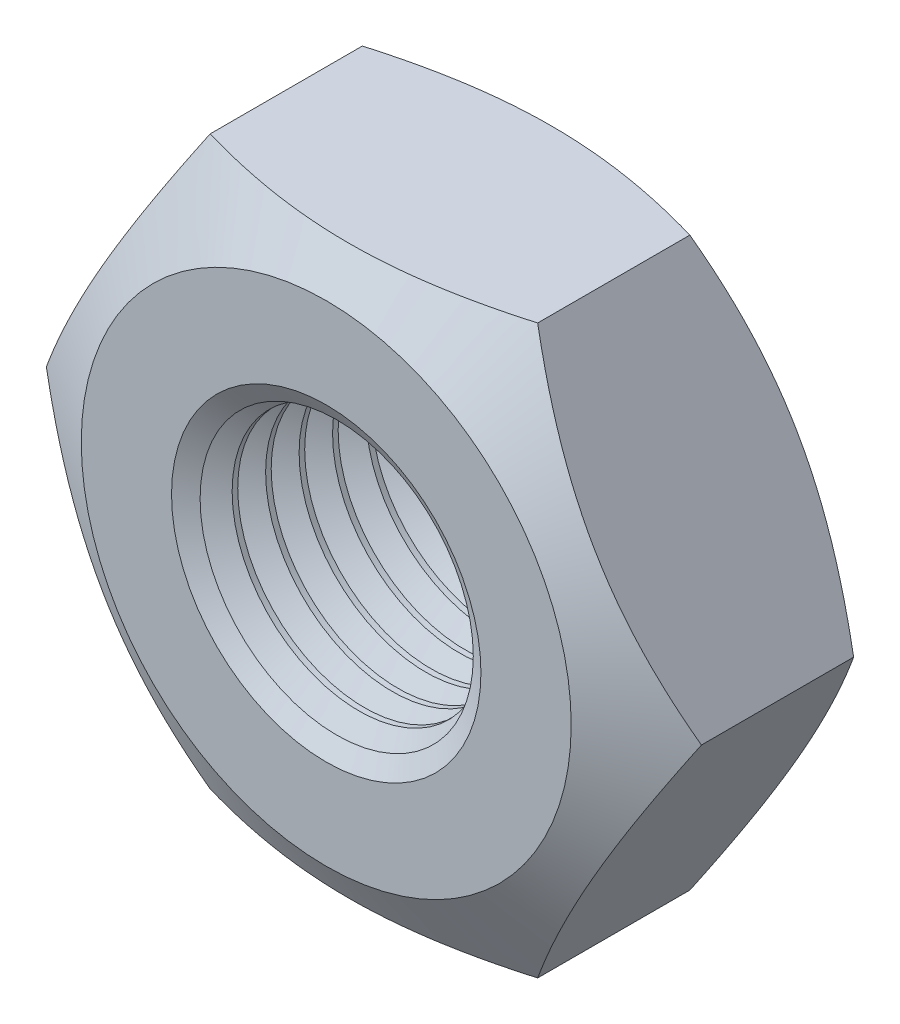
ISO-10303-21;
HEADER;
FILE_DESCRIPTION(('STEP AP214'),'2;1');
FILE_NAME('part.step','',(''),(''),'','','');
FILE_SCHEMA(('AUTOMOTIVE_DESIGN { 1 0 10303 214 1 1 1 1 }'));
ENDSEC;
DATA;
#1=APPLICATION_CONTEXT('core data for automotive mechanical design processes');
#2=APPLICATION_PROTOCOL_DEFINITION('international standard','automotive_design',2000,#1);
#3=PRODUCT_CONTEXT('',#1,'mechanical');
#4=PRODUCT('Part','Part','',(#3));
#5=PRODUCT_RELATED_PRODUCT_CATEGORY('part','',(#4));
#6=PRODUCT_DEFINITION_FORMATION('','',#4);
#7=PRODUCT_DEFINITION_CONTEXT('part definition',#1,'design');
#8=PRODUCT_DEFINITION('design','',#6,#7);
#9=PRODUCT_DEFINITION_SHAPE('','',#8);
#10=(LENGTH_UNIT() NAMED_UNIT(*) SI_UNIT(.MILLI.,.METRE.));
#11=(NAMED_UNIT(*) PLANE_ANGLE_UNIT() SI_UNIT($,.RADIAN.));
#12=(NAMED_UNIT(*) SI_UNIT($,.STERADIAN.) SOLID_ANGLE_UNIT());
#13=UNCERTAINTY_MEASURE_WITH_UNIT(LENGTH_MEASURE(1.E-05),#10,'distance_accuracy_value','');
#14=(GEOMETRIC_REPRESENTATION_CONTEXT(3) GLOBAL_UNCERTAINTY_ASSIGNED_CONTEXT((#13)) GLOBAL_UNIT_ASSIGNED_CONTEXT((#10,
#11,#12)) REPRESENTATION_CONTEXT('',''));
#15=CARTESIAN_POINT('',(0.,0.,0.));
#16=DIRECTION('',(0.,0.,1.));
#17=DIRECTION('',(1.,0.,0.));
#18=AXIS2_PLACEMENT_3D('',#15,#16,#17);
#19=CARTESIAN_POINT('',(0.,0.,-2.4));
#20=DIRECTION('',(0.,0.,1.));
#21=DIRECTION('',(1.,0.,0.));
#22=AXIS2_PLACEMENT_3D('',#19,#20,#21);
#23=CYLINDRICAL_SURFACE('',#22,1.2295);
#24=CARTESIAN_POINT('',(0.,0.,-0.966349999998783));
#25=DIRECTION('',(0.,0.,1.));
#26=DIRECTION('',(1.,0.,0.));
#27=AXIS2_PLACEMENT_3D('',#24,#25,#26);
#28=CIRCLE('',#27,1.2295000000222);
#29=CARTESIAN_POINT('',(1.2295000000222,0.,-0.966349999998783));
#30=VERTEX_POINT('',#29);
#31=EDGE_CURVE('E168',#30,#30,#28,.T.);
#32=ORIENTED_EDGE('',*,*,#31,.T.);
#33=EDGE_LOOP('',(#32));
#34=FACE_BOUND('',#33,.T.);
#35=CARTESIAN_POINT('',(0.,0.,-1.02044999999862));
#36=DIRECTION('',(0.,0.,-1.));
#37=DIRECTION('',(-1.,0.,0.));
#38=AXIS2_PLACEMENT_3D('',#35,#36,#37);
#39=CIRCLE('',#38,1.2295000000222);
#40=CARTESIAN_POINT('',(-1.2295000000222,0.,-1.02044999999862));
#41=VERTEX_POINT('',#40);
#42=EDGE_CURVE('E165',#41,#41,#39,.T.);
#43=ORIENTED_EDGE('',*,*,#42,.T.);
#44=EDGE_LOOP('',(#43));
#45=FACE_BOUND('',#44,.T.);
#46=ADVANCED_FACE('F17',(#34,#45),#23,.F.);
#47=CARTESIAN_POINT('',(0.,0.,-0.831100000084461));
#48=DIRECTION('',(0.,0.,1.));
#49=DIRECTION('',(1.,0.,0.));
#50=AXIS2_PLACEMENT_3D('',#47,#48,#49);
#51=CONICAL_SURFACE('',#50,1.46375987162628,1.04719755120105);
#52=ORIENTED_EDGE('',*,*,#31,.F.);
#53=EDGE_LOOP('',(#52));
#54=FACE_BOUND('',#53,.T.);
#55=CARTESIAN_POINT('',(0.,0.,-0.831100000027618));
#56=DIRECTION('',(0.,0.,-1.));
#57=DIRECTION('',(-1.,0.,0.));
#58=AXIS2_PLACEMENT_3D('',#55,#56,#57);
#59=CIRCLE('',#58,1.46375987179681);
#60=CARTESIAN_POINT('',(-1.46375987179681,0.,-0.831100000027618));
#61=VERTEX_POINT('',#60);
#62=EDGE_CURVE('E162',#61,#61,#59,.F.);
#63=ORIENTED_EDGE('',*,*,#62,.T.);
#64=EDGE_LOOP('',(#63));
#65=FACE_BOUND('',#64,.T.);
#66=ADVANCED_FACE('F386',(#54,#65),#51,.F.);
#67=CARTESIAN_POINT('',(0.,0.,-1.15570000002663));
#68=DIRECTION('',(0.,0.,-1.));
#69=DIRECTION('',(-1.,0.,0.));
#70=AXIS2_PLACEMENT_3D('',#67,#68,#69);
#71=CONICAL_SURFACE('',#70,1.46375987179681,1.04719755120105);
#72=CARTESIAN_POINT('',(0.,0.,-1.15570000008347));
#73=DIRECTION('',(0.,0.,1.));
#74=DIRECTION('',(1.,0.,0.));
#75=AXIS2_PLACEMENT_3D('',#72,#73,#74);
#76=CIRCLE('',#75,1.46375987173997);
#77=CARTESIAN_POINT('',(1.46375987173997,0.,-1.15570000008347));
#78=VERTEX_POINT('',#77);
#79=EDGE_CURVE('E159',#78,#78,#76,.F.);
#80=ORIENTED_EDGE('',*,*,#79,.T.);
#81=EDGE_LOOP('',(#80));
#82=FACE_BOUND('',#81,.T.);
#83=ORIENTED_EDGE('',*,*,#42,.F.);
#84=EDGE_LOOP('',(#83));
#85=FACE_BOUND('',#84,.T.);
#86=ADVANCED_FACE('F383',(#82,#85),#71,.F.);
#87=CARTESIAN_POINT('',(0.,0.,-0.831100000027618));
#88=DIRECTION('',(0.,0.,-1.));
#89=DIRECTION('',(0.,1.,0.));
#90=AXIS2_PLACEMENT_3D('',#87,#88,#89);
#91=CONICAL_SURFACE('',#90,1.46375987179681,1.04719755120105);
#92=CARTESIAN_POINT('',(0.,0.,-0.69585));
#93=DIRECTION('',(0.,0.,1.));
#94=DIRECTION('',(1.,0.,0.));
#95=AXIS2_PLACEMENT_3D('',#92,#93,#94);
#96=CIRCLE('',#95,1.2295);
#97=CARTESIAN_POINT('',(1.2295,0.,-0.69585));
#98=VERTEX_POINT('',#97);
#99=EDGE_CURVE('E156',#98,#98,#96,.T.);
#100=ORIENTED_EDGE('',*,*,#99,.T.);
#101=EDGE_LOOP('',(#100));
#102=FACE_BOUND('',#101,.T.);
#103=ORIENTED_EDGE('',*,*,#62,.F.);
#104=EDGE_LOOP('',(#103));
#105=FACE_BOUND('',#104,.T.);
#106=ADVANCED_FACE('F379',(#102,#105),#91,.F.);
#107=CARTESIAN_POINT('',(0.,0.,-1.15570000014031));
#108=DIRECTION('',(0.,0.,1.));
#109=DIRECTION('',(1.,0.,0.));
#110=AXIS2_PLACEMENT_3D('',#107,#108,#109);
#111=CONICAL_SURFACE('',#110,1.46375987162628,1.04719755120105);
#112=ORIENTED_EDGE('',*,*,#79,.F.);
#113=EDGE_LOOP('',(#112));
#114=FACE_BOUND('',#113,.T.);
#115=CARTESIAN_POINT('',(0.,0.,-1.29095));
#116=DIRECTION('',(0.,0.,1.));
#117=DIRECTION('',(1.,0.,0.));
#118=AXIS2_PLACEMENT_3D('',#115,#116,#117);
#119=CIRCLE('',#118,1.2295);
#120=CARTESIAN_POINT('',(1.2295,0.,-1.29095));
#121=VERTEX_POINT('',#120);
#122=EDGE_CURVE('E153',#121,#121,#119,.F.);
#123=ORIENTED_EDGE('',*,*,#122,.T.);
#124=EDGE_LOOP('',(#123));
#125=FACE_BOUND('',#124,.T.);
#126=ADVANCED_FACE('F375',(#114,#125),#111,.F.);
#127=CARTESIAN_POINT('',(0.,0.,-2.4));
#128=DIRECTION('',(0.,0.,1.));
#129=DIRECTION('',(1.,0.,0.));
#130=AXIS2_PLACEMENT_3D('',#127,#128,#129);
#131=CYLINDRICAL_SURFACE('',#130,1.2295);
#132=ORIENTED_EDGE('',*,*,#99,.F.);
#133=EDGE_LOOP('',(#132));
#134=FACE_BOUND('',#133,.T.);
#135=CARTESIAN_POINT('',(0.,0.,-0.641750000056618));
#136=DIRECTION('',(0.,0.,1.));
#137=DIRECTION('',(1.,0.,0.));
#138=AXIS2_PLACEMENT_3D('',#135,#136,#137);
#139=CIRCLE('',#138,1.2295000000222);
#140=CARTESIAN_POINT('',(1.2295000000222,0.,-0.641750000056618));
#141=VERTEX_POINT('',#140);
#142=EDGE_CURVE('E150',#141,#141,#139,.T.);
#143=ORIENTED_EDGE('',*,*,#142,.T.);
#144=EDGE_LOOP('',(#143));
#145=FACE_BOUND('',#144,.T.);
#146=ADVANCED_FACE('F371',(#134,#145),#131,.F.);
#147=CARTESIAN_POINT('',(0.,0.,-2.4));
#148=DIRECTION('',(0.,0.,1.));
#149=DIRECTION('',(1.,0.,0.));
#150=AXIS2_PLACEMENT_3D('',#147,#148,#149);
#151=CYLINDRICAL_SURFACE('',#150,1.2295);
#152=ORIENTED_EDGE('',*,*,#122,.F.);
#153=EDGE_LOOP('',(#152));
#154=FACE_BOUND('',#153,.T.);
#155=CARTESIAN_POINT('',(0.,0.,-1.34504999999763));
#156=DIRECTION('',(0.,0.,-1.));
#157=DIRECTION('',(-1.,0.,0.));
#158=AXIS2_PLACEMENT_3D('',#155,#156,#157);
#159=CIRCLE('',#158,1.2295000000222);
#160=CARTESIAN_POINT('',(-1.2295000000222,0.,-1.34504999999763));
#161=VERTEX_POINT('',#160);
#162=EDGE_CURVE('E147',#161,#161,#159,.T.);
#163=ORIENTED_EDGE('',*,*,#162,.T.);
#164=EDGE_LOOP('',(#163));
#165=FACE_BOUND('',#164,.T.);
#166=ADVANCED_FACE('F367',(#154,#165),#151,.F.);
#167=CARTESIAN_POINT('',(0.,0.,-0.506500000142296));
#168=DIRECTION('',(0.,0.,1.));
#169=DIRECTION('',(1.,0.,0.));
#170=AXIS2_PLACEMENT_3D('',#167,#168,#169);
#171=CONICAL_SURFACE('',#170,1.46375987162628,1.04719755120105);
#172=ORIENTED_EDGE('',*,*,#142,.F.);
#173=EDGE_LOOP('',(#172));
#174=FACE_BOUND('',#173,.T.);
#175=CARTESIAN_POINT('',(0.,0.,-0.506499999971766));
#176=DIRECTION('',(0.,0.,-1.));
#177=DIRECTION('',(-1.,0.,0.));
#178=AXIS2_PLACEMENT_3D('',#175,#176,#177);
#179=CIRCLE('',#178,1.46375987179681);
#180=CARTESIAN_POINT('',(-1.46375987179681,0.,-0.506499999971766));
#181=VERTEX_POINT('',#180);
#182=EDGE_CURVE('E144',#181,#181,#179,.F.);
#183=ORIENTED_EDGE('',*,*,#182,.T.);
#184=EDGE_LOOP('',(#183));
#185=FACE_BOUND('',#184,.T.);
#186=ADVANCED_FACE('F363',(#174,#185),#171,.F.);
#187=CARTESIAN_POINT('',(0.,0.,-1.48030000002564));
#188=DIRECTION('',(0.,0.,-1.));
#189=DIRECTION('',(-1.,0.,0.));
#190=AXIS2_PLACEMENT_3D('',#187,#188,#189);
#191=CONICAL_SURFACE('',#190,1.46375987179681,1.04719755120105);
#192=CARTESIAN_POINT('',(0.,0.,-1.48030000002564));
#193=DIRECTION('',(0.,0.,1.));
#194=DIRECTION('',(1.,0.,0.));
#195=AXIS2_PLACEMENT_3D('',#192,#193,#194);
#196=CIRCLE('',#195,1.46375987173997);
#197=CARTESIAN_POINT('',(1.46375987173997,0.,-1.48030000002564));
#198=VERTEX_POINT('',#197);
#199=EDGE_CURVE('E141',#198,#198,#196,.F.);
#200=ORIENTED_EDGE('',*,*,#199,.T.);
#201=EDGE_LOOP('',(#200));
#202=FACE_BOUND('',#201,.T.);
#203=ORIENTED_EDGE('',*,*,#162,.F.);
#204=EDGE_LOOP('',(#203));
#205=FACE_BOUND('',#204,.T.);
#206=ADVANCED_FACE('F359',(#202,#205),#191,.F.);
#207=CARTESIAN_POINT('',(0.,0.,-0.506499999971766));
#208=DIRECTION('',(0.,0.,-1.));
#209=DIRECTION('',(-1.,0.,0.));
#210=AXIS2_PLACEMENT_3D('',#207,#208,#209);
#211=CONICAL_SURFACE('',#210,1.46375987179681,1.04719755120105);
#212=CARTESIAN_POINT('',(0.,0.,-0.37125));
#213=DIRECTION('',(0.,0.,1.));
#214=DIRECTION('',(1.,0.,0.));
#215=AXIS2_PLACEMENT_3D('',#212,#213,#214);
#216=CIRCLE('',#215,1.2295);
#217=CARTESIAN_POINT('',(1.2295,0.,-0.37125));
#218=VERTEX_POINT('',#217);
#219=EDGE_CURVE('E138',#218,#218,#216,.T.);
#220=ORIENTED_EDGE('',*,*,#219,.T.);
#221=EDGE_LOOP('',(#220));
#222=FACE_BOUND('',#221,.T.);
#223=ORIENTED_EDGE('',*,*,#182,.F.);
#224=EDGE_LOOP('',(#223));
#225=FACE_BOUND('',#224,.T.);
#226=ADVANCED_FACE('F355',(#222,#225),#211,.F.);
#227=CARTESIAN_POINT('',(0.,0.,-1.48029999996879));
#228=DIRECTION('',(0.,0.,1.));
#229=DIRECTION('',(0.,-1.,0.));
#230=AXIS2_PLACEMENT_3D('',#227,#228,#229);
#231=CONICAL_SURFACE('',#230,1.46375987185365,1.04719755120105);
#232=ORIENTED_EDGE('',*,*,#199,.F.);
#233=EDGE_LOOP('',(#232));
#234=FACE_BOUND('',#233,.T.);
#235=CARTESIAN_POINT('',(0.,0.,-1.61555));
#236=DIRECTION('',(0.,0.,1.));
#237=DIRECTION('',(1.,0.,0.));
#238=AXIS2_PLACEMENT_3D('',#235,#236,#237);
#239=CIRCLE('',#238,1.2295);
#240=CARTESIAN_POINT('',(1.2295,0.,-1.61555));
#241=VERTEX_POINT('',#240);
#242=EDGE_CURVE('E135',#241,#241,#239,.F.);
#243=ORIENTED_EDGE('',*,*,#242,.T.);
#244=EDGE_LOOP('',(#243));
#245=FACE_BOUND('',#244,.T.);
#246=ADVANCED_FACE('F351',(#234,#245),#231,.F.);
#247=CARTESIAN_POINT('',(0.,0.,-2.4));
#248=DIRECTION('',(0.,0.,1.));
#249=DIRECTION('',(1.,0.,0.));
#250=AXIS2_PLACEMENT_3D('',#247,#248,#249);
#251=CYLINDRICAL_SURFACE('',#250,1.2295);
#252=ORIENTED_EDGE('',*,*,#219,.F.);
#253=EDGE_LOOP('',(#252));
#254=FACE_BOUND('',#253,.T.);
#255=CARTESIAN_POINT('',(0.,0.,-0.317150000057609));
#256=DIRECTION('',(0.,0.,1.));
#257=DIRECTION('',(1.,0.,0.));
#258=AXIS2_PLACEMENT_3D('',#255,#256,#257);
#259=CIRCLE('',#258,1.2295000000222);
#260=CARTESIAN_POINT('',(1.2295000000222,0.,-0.317150000057609));
#261=VERTEX_POINT('',#260);
#262=EDGE_CURVE('E132',#261,#261,#259,.T.);
#263=ORIENTED_EDGE('',*,*,#262,.T.);
#264=EDGE_LOOP('',(#263));
#265=FACE_BOUND('',#264,.T.);
#266=ADVANCED_FACE('F347',(#254,#265),#251,.F.);
#267=CARTESIAN_POINT('',(0.,0.,-2.4));
#268=DIRECTION('',(0.,0.,1.));
#269=DIRECTION('',(1.,0.,0.));
#270=AXIS2_PLACEMENT_3D('',#267,#268,#269);
#271=CYLINDRICAL_SURFACE('',#270,1.2295);
#272=ORIENTED_EDGE('',*,*,#242,.F.);
#273=EDGE_LOOP('',(#272));
#274=FACE_BOUND('',#273,.T.);
#275=CARTESIAN_POINT('',(0.,0.,-1.66964999999664));
#276=DIRECTION('',(0.,0.,-1.));
#277=DIRECTION('',(-1.,0.,0.));
#278=AXIS2_PLACEMENT_3D('',#275,#276,#277);
#279=CIRCLE('',#278,1.2295000000222);
#280=CARTESIAN_POINT('',(-1.2295000000222,0.,-1.66964999999664));
#281=VERTEX_POINT('',#280);
#282=EDGE_CURVE('E129',#281,#281,#279,.T.);
#283=ORIENTED_EDGE('',*,*,#282,.T.);
#284=EDGE_LOOP('',(#283));
#285=FACE_BOUND('',#284,.T.);
#286=ADVANCED_FACE('F343',(#274,#285),#271,.F.);
#287=CARTESIAN_POINT('',(0.,0.,-0.181900000143287));
#288=DIRECTION('',(0.,0.,1.));
#289=DIRECTION('',(1.,0.,0.));
#290=AXIS2_PLACEMENT_3D('',#287,#288,#289);
#291=CONICAL_SURFACE('',#290,1.46375987162628,1.04719755120105);
#292=ORIENTED_EDGE('',*,*,#262,.F.);
#293=EDGE_LOOP('',(#292));
#294=FACE_BOUND('',#293,.T.);
#295=CARTESIAN_POINT('',(0.,0.,-0.181899999972757));
#296=DIRECTION('',(0.,0.,-1.));
#297=DIRECTION('',(-1.,0.,0.));
#298=AXIS2_PLACEMENT_3D('',#295,#296,#297);
#299=CIRCLE('',#298,1.46375987179681);
#300=CARTESIAN_POINT('',(-1.46375987179681,0.,-0.181899999972757));
#301=VERTEX_POINT('',#300);
#302=EDGE_CURVE('E126',#301,#301,#299,.F.);
#303=ORIENTED_EDGE('',*,*,#302,.T.);
#304=EDGE_LOOP('',(#303));
#305=FACE_BOUND('',#304,.T.);
#306=ADVANCED_FACE('F339',(#294,#305),#291,.F.);
#307=CARTESIAN_POINT('',(0.,0.,-1.80490000002465));
#308=DIRECTION('',(0.,0.,-1.));
#309=DIRECTION('',(-1.,0.,0.));
#310=AXIS2_PLACEMENT_3D('',#307,#308,#309);
#311=CONICAL_SURFACE('',#310,1.46375987179681,1.04719755120105);
#312=CARTESIAN_POINT('',(0.,0.,-1.80490000002465));
#313=DIRECTION('',(0.,0.,1.));
#314=DIRECTION('',(1.,0.,0.));
#315=AXIS2_PLACEMENT_3D('',#312,#313,#314);
#316=CIRCLE('',#315,1.46375987173997);
#317=CARTESIAN_POINT('',(1.46375987173997,0.,-1.80490000002465));
#318=VERTEX_POINT('',#317);
#319=EDGE_CURVE('E123',#318,#318,#316,.F.);
#320=ORIENTED_EDGE('',*,*,#319,.T.);
#321=EDGE_LOOP('',(#320));
#322=FACE_BOUND('',#321,.T.);
#323=ORIENTED_EDGE('',*,*,#282,.F.);
#324=EDGE_LOOP('',(#323));
#325=FACE_BOUND('',#324,.T.);
#326=ADVANCED_FACE('F335',(#322,#325),#311,.F.);
#327=CARTESIAN_POINT('',(0.,0.,-0.181899999972757));
#328=DIRECTION('',(0.,0.,-1.));
#329=DIRECTION('',(-1.,0.,0.));
#330=AXIS2_PLACEMENT_3D('',#327,#328,#329);
#331=CONICAL_SURFACE('',#330,1.46375987179681,1.04719755114384);
#332=CARTESIAN_POINT('',(0.,0.,-0.101411623916192));
#333=DIRECTION('',(0.,0.,1.));
#334=DIRECTION('',(1.,0.,0.));
#335=AXIS2_PLACEMENT_3D('',#332,#333,#334);
#336=CIRCLE('',#335,1.32434991485297);
#337=CARTESIAN_POINT('',(1.32434991485297,0.,-0.101411623916192));
#338=VERTEX_POINT('',#337);
#339=EDGE_CURVE('E120',#338,#338,#336,.T.);
#340=ORIENTED_EDGE('',*,*,#339,.T.);
#341=EDGE_LOOP('',(#340));
#342=FACE_BOUND('',#341,.T.);
#343=ORIENTED_EDGE('',*,*,#302,.F.);
#344=EDGE_LOOP('',(#343));
#345=FACE_BOUND('',#344,.T.);
#346=ADVANCED_FACE('F331',(#342,#345),#331,.F.);
#347=CARTESIAN_POINT('',(0.,0.,-1.8048999999678));
#348=DIRECTION('',(0.,0.,1.));
#349=DIRECTION('',(0.,-1.,0.));
#350=AXIS2_PLACEMENT_3D('',#347,#348,#349);
#351=CONICAL_SURFACE('',#350,1.46375987185365,1.04719755120105);
#352=ORIENTED_EDGE('',*,*,#319,.F.);
#353=EDGE_LOOP('',(#352));
#354=FACE_BOUND('',#353,.T.);
#355=CARTESIAN_POINT('',(0.,0.,-1.94015));
#356=DIRECTION('',(0.,0.,1.));
#357=DIRECTION('',(1.,0.,0.));
#358=AXIS2_PLACEMENT_3D('',#355,#356,#357);
#359=CIRCLE('',#358,1.2295);
#360=CARTESIAN_POINT('',(1.2295,0.,-1.94015));
#361=VERTEX_POINT('',#360);
#362=EDGE_CURVE('E117',#361,#361,#359,.F.);
#363=ORIENTED_EDGE('',*,*,#362,.T.);
#364=EDGE_LOOP('',(#363));
#365=FACE_BOUND('',#364,.T.);
#366=ADVANCED_FACE('F324',(#354,#365),#351,.F.);
#367=CARTESIAN_POINT('',(0.,0.,-5.6843418860808E-11));
#368=DIRECTION('',(0.,0.,1.));
#369=DIRECTION('',(1.,0.,0.));
#370=AXIS2_PLACEMENT_3D('',#367,#368,#369);
#371=CONICAL_SURFACE('',#370,1.49999999990769,1.04719755122284);
#372=ORIENTED_EDGE('',*,*,#339,.F.);
#373=EDGE_LOOP('',(#372));
#374=FACE_BOUND('',#373,.T.);
#375=CARTESIAN_POINT('',(0.,0.,-2.40248556818506E-11));
#376=DIRECTION('',(0.,0.,1.));
#377=DIRECTION('',(1.,0.,0.));
#378=AXIS2_PLACEMENT_3D('',#375,#376,#377);
#379=CIRCLE('',#378,1.49999999996453);
#380=CARTESIAN_POINT('',(1.49999999996453,0.,-2.40248556818506E-11));
#381=VERTEX_POINT('',#380);
#382=EDGE_CURVE('E20',#381,#381,#379,.F.);
#383=ORIENTED_EDGE('',*,*,#382,.F.);
#384=EDGE_LOOP('',(#383));
#385=FACE_BOUND('',#384,.T.);
#386=ADVANCED_FACE('F316',(#374,#385),#371,.F.);
#387=CARTESIAN_POINT('',(0.,0.,-2.4));
#388=DIRECTION('',(0.,0.,1.));
#389=DIRECTION('',(1.,0.,0.));
#390=AXIS2_PLACEMENT_3D('',#387,#388,#389);
#391=CYLINDRICAL_SURFACE('',#390,1.2295);
#392=ORIENTED_EDGE('',*,*,#362,.F.);
#393=EDGE_LOOP('',(#392));
#394=FACE_BOUND('',#393,.T.);
#395=CARTESIAN_POINT('',(0.,0.,-1.99424999999565));
#396=DIRECTION('',(0.,0.,-1.));
#397=DIRECTION('',(-1.,0.,0.));
#398=AXIS2_PLACEMENT_3D('',#395,#396,#397);
#399=CIRCLE('',#398,1.2295000000222);
#400=CARTESIAN_POINT('',(-1.2295000000222,0.,-1.99424999999565));
#401=VERTEX_POINT('',#400);
#402=EDGE_CURVE('E114',#401,#401,#399,.T.);
#403=ORIENTED_EDGE('',*,*,#402,.T.);
#404=EDGE_LOOP('',(#403));
#405=FACE_BOUND('',#404,.T.);
#406=ADVANCED_FACE('F314',(#394,#405),#391,.F.);
#407=CARTESIAN_POINT('',(3.17542648054294,0.,0.));
#408=DIRECTION('',(0.,0.,1.));
#409=DIRECTION('',(1.,0.,0.));
#410=AXIS2_PLACEMENT_3D('',#407,#408,#409);
#411=PLANE('',#410);
#412=CARTESIAN_POINT('',(0.,0.,0.));
#413=DIRECTION('',(0.,0.,-1.));
#414=DIRECTION('',(-1.,0.,0.));
#415=AXIS2_PLACEMENT_3D('',#412,#413,#414);
#416=CIRCLE('',#415,2.37499999997226);
#417=CARTESIAN_POINT('',(-2.37499999997226,0.,0.));
#418=VERTEX_POINT('',#417);
#419=EDGE_CURVE('E113',#418,#418,#416,.T.);
#420=ORIENTED_EDGE('',*,*,#419,.F.);
#421=EDGE_LOOP('',(#420));
#422=FACE_BOUND('',#421,.T.);
#423=ORIENTED_EDGE('',*,*,#382,.T.);
#424=EDGE_LOOP('',(#423));
#425=FACE_BOUND('',#424,.T.);
#426=ADVANCED_FACE('F311',(#422,#425),#411,.T.);
#427=CARTESIAN_POINT('',(0.,0.,-2.12950000002365));
#428=DIRECTION('',(0.,0.,-1.));
#429=DIRECTION('',(-1.,0.,0.));
#430=AXIS2_PLACEMENT_3D('',#427,#428,#429);
#431=CONICAL_SURFACE('',#430,1.46375987179681,1.04719755120105);
#432=CARTESIAN_POINT('',(0.,0.,-2.1295000000805));
#433=DIRECTION('',(0.,0.,1.));
#434=DIRECTION('',(1.,0.,0.));
#435=AXIS2_PLACEMENT_3D('',#432,#433,#434);
#436=CIRCLE('',#435,1.46375987173997);
#437=CARTESIAN_POINT('',(1.46375987173997,0.,-2.1295000000805));
#438=VERTEX_POINT('',#437);
#439=EDGE_CURVE('E88',#438,#438,#436,.F.);
#440=ORIENTED_EDGE('',*,*,#439,.T.);
#441=EDGE_LOOP('',(#440));
#442=FACE_BOUND('',#441,.T.);
#443=ORIENTED_EDGE('',*,*,#402,.F.);
#444=EDGE_LOOP('',(#443));
#445=FACE_BOUND('',#444,.T.);
#446=ADVANCED_FACE('F221',(#442,#445),#431,.F.);
#447=CARTESIAN_POINT('',(0.,0.,-0.464899202654578));
#448=DIRECTION('',(0.,0.,-1.));
#449=DIRECTION('',(-1.,0.,0.));
#450=AXIS2_PLACEMENT_3D('',#447,#448,#449);
#451=CONICAL_SURFACE('',#450,3.18022903940118,1.04719755121431);
#452=ORIENTED_EDGE('',*,*,#419,.T.);
#453=EDGE_LOOP('',(#452));
#454=FACE_BOUND('',#453,.T.);
#455=CARTESIAN_POINT('',(1.58771324027225,-2.75,-0.46212644400531));
#456=CARTESIAN_POINT('',(1.4481724775294,-2.75,-0.42183281855623));
#457=CARTESIAN_POINT('',(1.30742720090781,-2.75,-0.385187875021507));
#458=CARTESIAN_POINT('',(1.02349973734727,-2.75,-0.321225226686883));
#459=CARTESIAN_POINT('',(0.880312507208986,-2.75,-0.293930146977579));
#460=CARTESIAN_POINT('',(0.595712494497151,-2.75,-0.251443387565256));
#461=CARTESIAN_POINT('',(0.454343489016983,-2.75,-0.235968901960677));
#462=CARTESIAN_POINT('',(0.170940637219599,-2.75,-0.21749905019473));
#463=CARTESIAN_POINT('',(0.0289078202878863,-2.75,-0.214488385729791));
#464=CARTESIAN_POINT('',(-0.236465261237079,-2.75,-0.220767592977351));
#465=CARTESIAN_POINT('',(-0.359845347223142,-2.75,-0.228515711186401));
#466=CARTESIAN_POINT('',(-0.605801738180952,-2.75,-0.253067732500346));
#467=CARTESIAN_POINT('',(-0.72837719309017,-2.75,-0.269880014319099));
#468=CARTESIAN_POINT('',(-0.974840277408814,-2.75,-0.311907464850764));
#469=CARTESIAN_POINT('',(-1.09869672932473,-2.75,-0.337300702059781));
#470=CARTESIAN_POINT('',(-1.34456284846544,-2.75,-0.394932615161668));
#471=CARTESIAN_POINT('',(-1.46657566308962,-2.75,-0.427157758540745));
#472=CARTESIAN_POINT('',(-1.58771324027224,-2.75,-0.462126444005308));
#473=B_SPLINE_CURVE_WITH_KNOTS('',3,(#455,#456,#457,#458,#459,#460,#461,#462,#463,#464,#465,
#466,#467,#468,#469,#470,#471,#472),.UNSPECIFIED.,.F.,.F.,(4,2,2,2,2,2,2,2,4),(0.,
0.435897015887765,0.872841498406344,1.29897295845228,1.72458122222451,2.09509820111108,
2.46595826646172,2.84504223091796,3.2233822135808),.UNSPECIFIED.);
#474=CARTESIAN_POINT('',(1.58771324027128,-2.75000000000033,-0.462126444005199));
#475=VERTEX_POINT('',#474);
#476=CARTESIAN_POINT('',(-1.58771324027185,-2.75,-0.462126444005197));
#477=VERTEX_POINT('',#476);
#478=EDGE_CURVE('E98',#475,#477,#473,.T.);
#479=ORIENTED_EDGE('',*,*,#478,.F.);
#480=CARTESIAN_POINT('',(3.17542648054312,3.02735119447868E-13,-0.46212644400519));
#481=CARTESIAN_POINT('',(3.1056560991717,-0.12084584539845,-0.42183281855612));
#482=CARTESIAN_POINT('',(3.03528346086091,-0.242734830415415,-0.385187875021408));
#483=CARTESIAN_POINT('',(2.89331972908065,-0.488623226690907,-0.321225226686806));
#484=CARTESIAN_POINT('',(2.82172611401151,-0.612627005488183,-0.293930146977514));
#485=CARTESIAN_POINT('',(2.6794261076556,-0.859097846413993,-0.251443387565213));
#486=CARTESIAN_POINT('',(2.60874160491552,-0.981526996467553,-0.235968901960646));
#487=CARTESIAN_POINT('',(2.46704017901683,-1.22696106562903,-0.21749905019472));
#488=CARTESIAN_POINT('',(2.39602377055098,-1.34996509326295,-0.214488385729792));
#489=CARTESIAN_POINT('',(2.26333722978852,-1.5797849233441,-0.22076759297737));
#490=CARTESIAN_POINT('',(2.2016471867955,-1.68663521212911,-0.228515711186425));
#491=CARTESIAN_POINT('',(2.07866899131662,-1.89963969492167,-0.253067732500377));
#492=CARTESIAN_POINT('',(2.01738126386203,-2.00579315275346,-0.26988001431913));
#493=CARTESIAN_POINT('',(1.89414972170273,-2.21923644486842,-0.311907464850794));
#494=CARTESIAN_POINT('',(1.83222149574479,-2.32649927865018,-0.337300702059807));
#495=CARTESIAN_POINT('',(1.70928843617446,-2.53942558375589,-0.394932615161684));
#496=CARTESIAN_POINT('',(1.64828202886239,-2.64509178080764,-0.427157758540754));
#497=CARTESIAN_POINT('',(1.58771324027109,-2.75000000000066,-0.462126444005309));
#498=B_SPLINE_CURVE_WITH_KNOTS('',3,(#480,#481,#482,#483,#484,#485,#486,#487,#488,#489,#490,
#491,#492,#493,#494,#495,#496,#497),.UNSPECIFIED.,.F.,.F.,(4,2,2,2,2,2,2,2,4),(0.,
0.435897015887736,0.872841498406287,1.2989729584522,1.72458122222441,2.09509820111089,
2.46595826646145,2.8450422309176,3.22338221358036),.UNSPECIFIED.);
#499=CARTESIAN_POINT('',(3.1754264805681,0.,-0.462126444034539));
#500=VERTEX_POINT('',#499);
#501=EDGE_CURVE('E102',#500,#475,#498,.T.);
#502=ORIENTED_EDGE('',*,*,#501,.F.);
#503=CARTESIAN_POINT('',(1.58771324027108,2.75000000000067,-0.462126444005309));
#504=CARTESIAN_POINT('',(1.6574836216425,2.62915415460191,-0.421832818556228));
#505=CARTESIAN_POINT('',(1.7278562599533,2.50726516958494,-0.385187875021506));
#506=CARTESIAN_POINT('',(1.86981999173357,2.26137677330943,-0.321225226686882));
#507=CARTESIAN_POINT('',(1.94141360680271,2.13737299451215,-0.293930146977579));
#508=CARTESIAN_POINT('',(2.08371361315863,1.89090215358633,-0.251443387565256));
#509=CARTESIAN_POINT('',(2.15439811589871,1.76847300353276,-0.235968901960677));
#510=CARTESIAN_POINT('',(2.29609954179741,1.52303893437127,-0.217499050194729));
#511=CARTESIAN_POINT('',(2.36711595026326,1.40003490673734,-0.214488385729791));
#512=CARTESIAN_POINT('',(2.49980249102573,1.17021507665619,-0.22076759297735));
#513=CARTESIAN_POINT('',(2.56149253401874,1.06336478787119,-0.228515711186395));
#514=CARTESIAN_POINT('',(2.68447072949761,0.850360305078644,-0.253067732500329));
#515=CARTESIAN_POINT('',(2.7457584569522,0.744206847246857,-0.269880014319073));
#516=CARTESIAN_POINT('',(2.86898999911149,0.530763555131906,-0.311907464850717));
#517=CARTESIAN_POINT('',(2.93091822506943,0.42350072135015,-0.337300702059721));
#518=CARTESIAN_POINT('',(3.05385128463975,0.21057441624446,-0.394932615161579));
#519=CARTESIAN_POINT('',(3.11485769195182,0.104908219192712,-0.427157758540641));
#520=CARTESIAN_POINT('',(3.17542648054312,-3.07539058053065E-13,-0.462126444005188));
#521=B_SPLINE_CURVE_WITH_KNOTS('',3,(#503,#504,#505,#506,#507,#508,#509,#510,#511,#512,#513,
#514,#515,#516,#517,#518,#519,#520),.UNSPECIFIED.,.F.,.F.,(4,2,2,2,2,2,2,2,4),(0.,
0.435897015887764,0.872841498406342,1.29897295845228,1.72458122222451,2.09509820111097,
2.46595826646151,2.84504223091763,3.22338221358037),.UNSPECIFIED.);
#522=CARTESIAN_POINT('',(1.58771324027185,2.75,-0.462126444005197));
#523=VERTEX_POINT('',#522);
#524=EDGE_CURVE('E106',#523,#500,#521,.T.);
#525=ORIENTED_EDGE('',*,*,#524,.F.);
#526=CARTESIAN_POINT('',(-1.58771324027224,2.75,-0.462126444005308));
#527=CARTESIAN_POINT('',(-1.4481724775294,2.75,-0.421832818556228));
#528=CARTESIAN_POINT('',(-1.3074272009078,2.75,-0.385187875021507));
#529=CARTESIAN_POINT('',(-1.02349973734726,2.75,-0.321225226686883));
#530=CARTESIAN_POINT('',(-0.880312507208979,2.75,-0.293930146977579));
#531=CARTESIAN_POINT('',(-0.595712494497145,2.75,-0.251443387565256));
#532=CARTESIAN_POINT('',(-0.454343489016977,2.75,-0.235968901960677));
#533=CARTESIAN_POINT('',(-0.170940637219593,2.75,-0.21749905019473));
#534=CARTESIAN_POINT('',(-0.0289078202878801,2.75,-0.214488385729792));
#535=CARTESIAN_POINT('',(0.236465261237085,2.75,-0.220767592977352));
#536=CARTESIAN_POINT('',(0.359845347223146,2.75,-0.228515711186402));
#537=CARTESIAN_POINT('',(0.605801738180955,2.75,-0.253067732500347));
#538=CARTESIAN_POINT('',(0.728377193090173,2.75,-0.269880014319099));
#539=CARTESIAN_POINT('',(0.974840277408815,2.75,-0.311907464850764));
#540=CARTESIAN_POINT('',(1.09869672932473,2.75,-0.337300702059781));
#541=CARTESIAN_POINT('',(1.34456284846544,2.75,-0.394932615161667));
#542=CARTESIAN_POINT('',(1.46657566308961,2.75,-0.427157758540745));
#543=CARTESIAN_POINT('',(1.58771324027223,2.75,-0.462126444005307));
#544=B_SPLINE_CURVE_WITH_KNOTS('',3,(#526,#527,#528,#529,#530,#531,#532,#533,#534,#535,#536,
#537,#538,#539,#540,#541,#542,#543),.UNSPECIFIED.,.F.,.F.,(4,2,2,2,2,2,2,2,4),(0.,
0.435897015887764,0.872841498406343,1.29897295845228,1.72458122222451,2.09509820111108,
2.46595826646172,2.84504223091795,3.22338221358079),.UNSPECIFIED.);
#545=CARTESIAN_POINT('',(-1.58771324027128,2.75000000000033,-0.462126444005197));
#546=VERTEX_POINT('',#545);
#547=EDGE_CURVE('E84',#546,#523,#544,.T.);
#548=ORIENTED_EDGE('',*,*,#547,.F.);
#549=CARTESIAN_POINT('',(-3.17542648054312,-3.05006969641506E-13,-0.462126444005188));
#550=CARTESIAN_POINT('',(-3.1056560991717,0.120845845398448,-0.421832818556118));
#551=CARTESIAN_POINT('',(-3.0352834608609,0.242734830415412,-0.385187875021406));
#552=CARTESIAN_POINT('',(-2.89331972908064,0.488623226690905,-0.321225226686804));
#553=CARTESIAN_POINT('',(-2.82172611401151,0.612627005488181,-0.293930146977512));
#554=CARTESIAN_POINT('',(-2.6794261076556,0.85909784641399,-0.251443387565211));
#555=CARTESIAN_POINT('',(-2.60874160491552,0.98152699646755,-0.235968901960643));
#556=CARTESIAN_POINT('',(-2.46704017901683,1.22696106562903,-0.217499050194718));
#557=CARTESIAN_POINT('',(-2.39602377055098,1.34996509326295,-0.21448838572979));
#558=CARTESIAN_POINT('',(-2.26333722978851,1.5797849233441,-0.220767592977367));
#559=CARTESIAN_POINT('',(-2.2016471867955,1.68663521212911,-0.228515711186422));
#560=CARTESIAN_POINT('',(-2.07866899131662,1.89963969492166,-0.253067732500374));
#561=CARTESIAN_POINT('',(-2.01738126386202,2.00579315275346,-0.269880014319128));
#562=CARTESIAN_POINT('',(-1.89414972170273,2.21923644486842,-0.311907464850791));
#563=CARTESIAN_POINT('',(-1.83222149574479,2.32649927865018,-0.337300702059805));
#564=CARTESIAN_POINT('',(-1.70928843617446,2.53942558375589,-0.394932615161682));
#565=CARTESIAN_POINT('',(-1.64828202886238,2.64509178080764,-0.427157758540753));
#566=CARTESIAN_POINT('',(-1.58771324027109,2.75000000000067,-0.462126444005309));
#567=B_SPLINE_CURVE_WITH_KNOTS('',3,(#549,#550,#551,#552,#553,#554,#555,#556,#557,#558,#559,
#560,#561,#562,#563,#564,#565,#566),.UNSPECIFIED.,.F.,.F.,(4,2,2,2,2,2,2,2,4),(0.,
0.435897015887736,0.872841498406286,1.29897295845219,1.7245812222244,2.09509820111089,
2.46595826646145,2.8450422309176,3.22338221358036),.UNSPECIFIED.);
#568=CARTESIAN_POINT('',(-3.17542648054085,-1.52481955337242E-13,-0.462126444005652));
#569=VERTEX_POINT('',#568);
#570=EDGE_CURVE('E81',#569,#546,#567,.T.);
#571=ORIENTED_EDGE('',*,*,#570,.F.);
#572=CARTESIAN_POINT('',(-1.58771324027108,-2.75000000000066,-0.462126444005308));
#573=CARTESIAN_POINT('',(-1.65748362164251,-2.62915415460191,-0.421832818556228));
#574=CARTESIAN_POINT('',(-1.7278562599533,-2.50726516958494,-0.385187875021506));
#575=CARTESIAN_POINT('',(-1.86981999173357,-2.26137677330943,-0.321225226686882));
#576=CARTESIAN_POINT('',(-1.94141360680271,-2.13737299451215,-0.293930146977578));
#577=CARTESIAN_POINT('',(-2.08371361315863,-1.89090215358633,-0.251443387565255));
#578=CARTESIAN_POINT('',(-2.15439811589871,-1.76847300353276,-0.235968901960676));
#579=CARTESIAN_POINT('',(-2.29609954179741,-1.52303893437127,-0.217499050194729));
#580=CARTESIAN_POINT('',(-2.36711595026326,-1.40003490673734,-0.214488385729791));
#581=CARTESIAN_POINT('',(-2.49980249102573,-1.17021507665619,-0.22076759297735));
#582=CARTESIAN_POINT('',(-2.56149253401874,-1.06336478787118,-0.228515711186396));
#583=CARTESIAN_POINT('',(-2.68447072949761,-0.850360305078643,-0.253067732500329));
#584=CARTESIAN_POINT('',(-2.7457584569522,-0.744206847246856,-0.269880014319073));
#585=CARTESIAN_POINT('',(-2.86898999911149,-0.530763555131905,-0.311907464850717));
#586=CARTESIAN_POINT('',(-2.93091822506943,-0.42350072135015,-0.337300702059721));
#587=CARTESIAN_POINT('',(-3.05385128463975,-0.21057441624446,-0.394932615161579));
#588=CARTESIAN_POINT('',(-3.11485769195182,-0.104908219192712,-0.427157758540641));
#589=CARTESIAN_POINT('',(-3.17542648054312,3.06602333446702E-13,-0.462126444005187));
#590=B_SPLINE_CURVE_WITH_KNOTS('',3,(#572,#573,#574,#575,#576,#577,#578,#579,#580,#581,#582,
#583,#584,#585,#586,#587,#588,#589),.UNSPECIFIED.,.F.,.F.,(4,2,2,2,2,2,2,2,4),(0.,
0.435897015887763,0.872841498406342,1.29897295845228,1.72458122222451,2.09509820111097,
2.46595826646151,2.84504223091763,3.22338221358036),.UNSPECIFIED.);
#591=EDGE_CURVE('E67',#477,#569,#590,.T.);
#592=ORIENTED_EDGE('',*,*,#591,.F.);
#593=EDGE_LOOP('',(#479,#502,#525,#548,#571,#592));
#594=FACE_BOUND('',#593,.T.);
#595=ADVANCED_FACE('F82',(#454,#594),#451,.T.);
#596=CARTESIAN_POINT('',(0.,0.,-2.12950000013734));
#597=DIRECTION('',(0.,0.,1.));
#598=DIRECTION('',(1.,0.,0.));
#599=AXIS2_PLACEMENT_3D('',#596,#597,#598);
#600=CONICAL_SURFACE('',#599,1.46375987162628,1.04719755118915);
#601=ORIENTED_EDGE('',*,*,#439,.F.);
#602=EDGE_LOOP('',(#601));
#603=FACE_BOUND('',#602,.T.);
#604=CARTESIAN_POINT('',(0.,0.,-2.23093749997361));
#605=DIRECTION('',(0.,0.,-1.));
#606=DIRECTION('',(-1.,0.,0.));
#607=AXIS2_PLACEMENT_3D('',#604,#605,#606);
#608=CIRCLE('',#607,1.28806496792322);
#609=CARTESIAN_POINT('',(-1.28806496792322,0.,-2.23093749997361));
#610=VERTEX_POINT('',#609);
#611=EDGE_CURVE('E93',#610,#610,#608,.T.);
#612=ORIENTED_EDGE('',*,*,#611,.T.);
#613=EDGE_LOOP('',(#612));
#614=FACE_BOUND('',#613,.T.);
#615=ADVANCED_FACE('F220',(#603,#614),#600,.F.);
#616=CARTESIAN_POINT('',(-1.58771324027147,2.75,-2.4));
#617=DIRECTION('',(-0.866025403784439,0.5,0.));
#618=DIRECTION('',(-0.5,-0.866025403784439,0.));
#619=AXIS2_PLACEMENT_3D('',#616,#617,#618);
#620=PLANE('',#619);
#621=CARTESIAN_POINT('',(-3.17542648052623,2.89378213648094E-11,-1.9378735560098));
#622=CARTESIAN_POINT('',(-3.10565609917088,0.120845845399868,-1.97816718144907));
#623=CARTESIAN_POINT('',(-3.03528346087634,0.242734830388668,-2.01481212497545));
#624=CARTESIAN_POINT('',(-2.89331972913113,0.488623226603451,-2.07877477329711));
#625=CARTESIAN_POINT('',(-2.82172611408082,0.612627005368129,-2.10606985300208));
#626=CARTESIAN_POINT('',(-2.67942610772831,0.85909784628804,-2.14855661242314));
#627=CARTESIAN_POINT('',(-2.60874160497239,0.981526996369046,-2.16403109803524));
#628=CARTESIAN_POINT('',(-2.46704017903912,1.22696106559042,-2.18250094980956));
#629=CARTESIAN_POINT('',(-2.39602377055453,1.34996509325681,-2.18551161427508));
#630=CARTESIAN_POINT('',(-2.26333723387874,1.57978491625962,-2.17923240722191));
#631=CARTESIAN_POINT('',(-2.20164719498233,1.6866351979491,-2.17148428985047));
#632=CARTESIAN_POINT('',(-2.07866900762862,1.89963966666845,-2.14693227136512));
#633=CARTESIAN_POINT('',(-2.01738128420243,2.00579311752285,-2.13011999154007));
#634=CARTESIAN_POINT('',(-1.89414975019319,2.2192363955215,-2.08809254597998));
#635=CARTESIAN_POINT('',(-1.83222152835291,2.32649922217127,-2.06269931178485));
#636=CARTESIAN_POINT('',(-1.70928847686808,2.53942551327246,-2.00506740536642));
#637=CARTESIAN_POINT('',(-1.64828207352439,2.64509170345077,-1.97284226565293));
#638=CARTESIAN_POINT('',(-1.58771328884583,2.74999991586673,-1.93787358404458));
#639=B_SPLINE_CURVE_WITH_KNOTS('',3,(#621,#622,#623,#624,#625,#626,#627,#628,#629,#630,#631,
#632,#633,#634,#635,#636,#637,#638),.UNSPECIFIED.,.F.,.F.,(4,2,2,2,2,2,2,2,4),(0.,
0.435897015787165,0.872841498192463,1.29897295833624,1.72458122221551,2.0950981764876,
2.4659582171327,2.84504215560044,3.22338211247265),.UNSPECIFIED.);
#640=CARTESIAN_POINT('',(-3.17542648049922,0.,-1.93787355604062));
#641=VERTEX_POINT('',#640);
#642=CARTESIAN_POINT('',(-1.58771326513156,2.74999995694107,-1.93787357035313));
#643=VERTEX_POINT('',#642);
#644=EDGE_CURVE('E91',#641,#643,#639,.T.);
#645=ORIENTED_EDGE('',*,*,#644,.F.);
#646=DIRECTION('',(0.,0.,1.));
#647=VECTOR('',#646,1.);
#648=CARTESIAN_POINT('',(-3.17542648054294,0.,-2.4));
#649=LINE('',#648,#647);
#650=EDGE_CURVE('E72',#569,#641,#649,.F.);
#651=ORIENTED_EDGE('',*,*,#650,.F.);
#652=ORIENTED_EDGE('',*,*,#570,.T.);
#653=DIRECTION('',(0.,0.,1.));
#654=VECTOR('',#653,1.);
#655=CARTESIAN_POINT('',(-1.58771324027147,2.75,-2.4));
#656=LINE('',#655,#654);
#657=EDGE_CURVE('E107',#643,#546,#656,.T.);
#658=ORIENTED_EDGE('',*,*,#657,.F.);
#659=EDGE_LOOP('',(#645,#651,#652,#658));
#660=FACE_BOUND('',#659,.T.);
#661=ADVANCED_FACE('F90',(#660),#620,.T.);
#662=CARTESIAN_POINT('',(1.58771324027146,2.75,-2.4));
#663=DIRECTION('',(0.,1.,0.));
#664=DIRECTION('',(0.,0.,1.));
#665=AXIS2_PLACEMENT_3D('',#662,#663,#664);
#666=PLANE('',#665);
#667=CARTESIAN_POINT('',(-1.58771330687583,2.75,-1.93787353677313));
#668=CARTESIAN_POINT('',(-1.44817254306224,2.75,-1.97816716378625));
#669=CARTESIAN_POINT('',(-1.30742726536333,2.75,-2.01481210898575));
#670=CARTESIAN_POINT('',(-1.02349979954539,2.75,-2.07877476078294));
#671=CARTESIAN_POINT('',(-0.88031256822639,2.75,-2.10606984228831));
#672=CARTESIAN_POINT('',(-0.59571255308687,2.75,-2.14855660528049));
#673=CARTESIAN_POINT('',(-0.454343546363232,2.75,-2.16403109267037));
#674=CARTESIAN_POINT('',(-0.170940691931338,2.75,-2.18250094787654));
#675=CARTESIAN_POINT('',(-0.0289078736088368,2.75,-2.1855116139974));
#676=CARTESIAN_POINT('',(0.236465205401434,2.75,-2.17923240969276));
#677=CARTESIAN_POINT('',(0.35984528747696,2.75,-2.17148429321601));
#678=CARTESIAN_POINT('',(0.605801670763702,2.75,-2.14693227580366));
#679=CARTESIAN_POINT('',(0.728377121912617,2.75,-2.13011999615536));
#680=CARTESIAN_POINT('',(0.974840198676959,2.75,-2.08809255028817));
#681=CARTESIAN_POINT('',(1.09869664680364,2.75,-2.06269931558608));
#682=CARTESIAN_POINT('',(1.34456275852857,2.75,-2.00506740762524));
#683=CARTESIAN_POINT('',(1.46657556952556,2.75,-1.97284226687842));
#684=CARTESIAN_POINT('',(1.5877131431244,2.75,-1.9378735840441));
#685=B_SPLINE_CURVE_WITH_KNOTS('',3,(#667,#668,#669,#670,#671,#672,#673,#674,#675,#676,#677,
#678,#679,#680,#681,#682,#683,#684),.UNSPECIFIED.,.F.,.F.,(4,2,2,2,2,2,2,2,4),(0.,
0.435897020282306,0.87284150729903,1.29897297163798,1.72458123966891,2.09509820655196,
2.46595825985672,2.84504221167033,3.22338218180316),.UNSPECIFIED.);
#686=CARTESIAN_POINT('',(1.58771319055287,2.75,-1.93787357035268));
#687=VERTEX_POINT('',#686);
#688=EDGE_CURVE('E259',#643,#687,#685,.T.);
#689=ORIENTED_EDGE('',*,*,#688,.F.);
#690=ORIENTED_EDGE('',*,*,#657,.T.);
#691=ORIENTED_EDGE('',*,*,#547,.T.);
#692=DIRECTION('',(0.,0.,1.));
#693=VECTOR('',#692,1.);
#694=CARTESIAN_POINT('',(1.58771324027147,2.75,-2.4));
#695=LINE('',#694,#693);
#696=EDGE_CURVE('E103',#687,#523,#695,.T.);
#697=ORIENTED_EDGE('',*,*,#696,.F.);
#698=EDGE_LOOP('',(#689,#690,#691,#697));
#699=FACE_BOUND('',#698,.T.);
#700=ADVANCED_FACE('F251',(#699),#666,.T.);
#701=CARTESIAN_POINT('',(3.17542648054294,0.,-2.4));
#702=DIRECTION('',(0.866025403784439,0.5,0.));
#703=DIRECTION('',(-0.5,0.866025403784439,0.));
#704=AXIS2_PLACEMENT_3D('',#701,#702,#703);
#705=PLANE('',#704);
#706=CARTESIAN_POINT('',(1.58771320697914,2.750000057664,-1.93787353677882));
#707=CARTESIAN_POINT('',(1.65748358890155,2.6291542113109,-1.97816716380047));
#708=CARTESIAN_POINT('',(1.72785622776682,2.50726522533357,-2.01481210900696));
#709=CARTESIAN_POINT('',(1.86981996070989,2.26137682704402,-2.07877476081429));
#710=CARTESIAN_POINT('',(1.94141357638772,2.13737304719247,-2.10606984232255));
#711=CARTESIAN_POINT('',(2.0837135839599,1.89090220416001,-2.14855660530311));
#712=CARTESIAN_POINT('',(2.1543980873054,1.76847305305784,-2.16403109268403));
#713=CARTESIAN_POINT('',(2.29609951448575,1.52303898167645,-2.18250094787906));
#714=CARTESIAN_POINT('',(2.36711592362772,1.40003495287146,-2.18551161399799));
#715=CARTESIAN_POINT('',(2.49980246721575,1.17021511789629,-2.17923240949681));
#716=CARTESIAN_POINT('',(2.56149251234689,1.06336482540793,-2.17148429218204));
#717=CARTESIAN_POINT('',(2.684470712109,0.850360335196608,-2.14693227194127));
#718=CARTESIAN_POINT('',(2.74575844170864,0.744206873649476,-2.13011999029987));
#719=CARTESIAN_POINT('',(2.86898998823436,0.53076357397165,-2.08809253946318));
#720=CARTESIAN_POINT('',(2.93091821641206,0.423500736345159,-2.06269930174872));
#721=CARTESIAN_POINT('',(3.05385128035353,0.210574423668416,-2.00506738710814));
#722=CARTESIAN_POINT('',(3.11485768981722,0.104908222889948,-1.97284224269792));
#723=CARTESIAN_POINT('',(3.17542648052623,2.89338967989021E-11,-1.9378735560098));
#724=B_SPLINE_CURVE_WITH_KNOTS('',3,(#706,#707,#708,#709,#710,#711,#712,#713,#714,#715,#716,
#717,#718,#719,#720,#721,#722,#723),.UNSPECIFIED.,.F.,.F.,(4,2,2,2,2,2,2,2,4),(0.,
0.435897020379233,0.872841507505468,1.29897297174322,1.7245812396638,2.09509823114205,
2.46595830913299,2.84504228691473,3.22338228281795),.UNSPECIFIED.);
#725=CARTESIAN_POINT('',(3.17542648052547,0.,-1.93787355598829));
#726=VERTEX_POINT('',#725);
#727=EDGE_CURVE('E265',#687,#726,#724,.T.);
#728=ORIENTED_EDGE('',*,*,#727,.F.);
#729=ORIENTED_EDGE('',*,*,#696,.T.);
#730=ORIENTED_EDGE('',*,*,#524,.T.);
#731=DIRECTION('',(0.,0.,1.));
#732=VECTOR('',#731,1.);
#733=CARTESIAN_POINT('',(3.17542648054294,0.,-2.4));
#734=LINE('',#733,#732);
#735=EDGE_CURVE('E99',#726,#500,#734,.T.);
#736=ORIENTED_EDGE('',*,*,#735,.F.);
#737=EDGE_LOOP('',(#728,#729,#730,#736));
#738=FACE_BOUND('',#737,.T.);
#739=ADVANCED_FACE('F255',(#738),#705,.T.);
#740=CARTESIAN_POINT('',(1.58771324027147,-2.75,-2.4));
#741=DIRECTION('',(0.866025403784439,-0.5,0.));
#742=DIRECTION('',(0.5,0.866025403784439,0.));
#743=AXIS2_PLACEMENT_3D('',#740,#741,#742);
#744=PLANE('',#743);
#745=CARTESIAN_POINT('',(3.17542648052624,-2.89398286509922E-11,-1.9378735560098));
#746=CARTESIAN_POINT('',(3.10565609917088,-0.12084584539987,-1.97816718144907));
#747=CARTESIAN_POINT('',(3.03528346087635,-0.24273483038867,-2.01481212497545));
#748=CARTESIAN_POINT('',(2.89331972913114,-0.488623226603454,-2.07877477329711));
#749=CARTESIAN_POINT('',(2.82172611408082,-0.612627005368132,-2.10606985300208));
#750=CARTESIAN_POINT('',(2.67942610772832,-0.859097846288043,-2.14855661242314));
#751=CARTESIAN_POINT('',(2.60874160497239,-0.981526996369049,-2.16403109803524));
#752=CARTESIAN_POINT('',(2.46704017903912,-1.22696106559042,-2.18250094980955));
#753=CARTESIAN_POINT('',(2.39602377055453,-1.34996509325681,-2.18551161427508));
#754=CARTESIAN_POINT('',(2.26333723387874,-1.57978491625963,-2.1792324072219));
#755=CARTESIAN_POINT('',(2.20164719498233,-1.6866351979491,-2.17148428985047));
#756=CARTESIAN_POINT('',(2.07866900762863,-1.89963966666844,-2.14693227136511));
#757=CARTESIAN_POINT('',(2.01738128420244,-2.00579311752284,-2.13011999154007));
#758=CARTESIAN_POINT('',(1.8941497501932,-2.21923639552148,-2.08809254597998));
#759=CARTESIAN_POINT('',(1.83222152835292,-2.32649922217125,-2.06269931178485));
#760=CARTESIAN_POINT('',(1.7092884768681,-2.53942551327244,-2.00506740536643));
#761=CARTESIAN_POINT('',(1.64828207352441,-2.64509170345074,-1.97284226565293));
#762=CARTESIAN_POINT('',(1.58771328884586,-2.7499999158667,-1.93787358404458));
#763=B_SPLINE_CURVE_WITH_KNOTS('',3,(#745,#746,#747,#748,#749,#750,#751,#752,#753,#754,#755,
#756,#757,#758,#759,#760,#761,#762),.UNSPECIFIED.,.F.,.F.,(4,2,2,2,2,2,2,2,4),(0.,
0.435897015787166,0.872841498192464,1.29897295833625,1.72458122221551,2.09509817648759,
2.46595821713269,2.84504215560042,3.22338211247262),.UNSPECIFIED.);
#764=CARTESIAN_POINT('',(1.58771326513157,-2.74999995694105,-1.93787357035314));
#765=VERTEX_POINT('',#764);
#766=EDGE_CURVE('E270',#726,#765,#763,.T.);
#767=ORIENTED_EDGE('',*,*,#766,.F.);
#768=ORIENTED_EDGE('',*,*,#735,.T.);
#769=ORIENTED_EDGE('',*,*,#501,.T.);
#770=DIRECTION('',(0.,0.,1.));
#771=VECTOR('',#770,1.);
#772=CARTESIAN_POINT('',(1.58771324027148,-2.75,-2.4));
#773=LINE('',#772,#771);
#774=EDGE_CURVE('E77',#765,#475,#773,.T.);
#775=ORIENTED_EDGE('',*,*,#774,.F.);
#776=EDGE_LOOP('',(#767,#768,#769,#775));
#777=FACE_BOUND('',#776,.T.);
#778=ADVANCED_FACE('F275',(#777),#744,.T.);
#779=CARTESIAN_POINT('',(-1.58771324027147,-2.75,-2.4));
#780=DIRECTION('',(0.,-1.,0.));
#781=DIRECTION('',(1.,0.,0.));
#782=AXIS2_PLACEMENT_3D('',#779,#780,#781);
#783=PLANE('',#782);
#784=CARTESIAN_POINT('',(1.58771330687587,-2.75,-1.93787353677312));
#785=CARTESIAN_POINT('',(1.44817254306228,-2.75,-1.97816716378624));
#786=CARTESIAN_POINT('',(1.30742726536337,-2.75,-2.01481210898574));
#787=CARTESIAN_POINT('',(1.02349979954542,-2.75,-2.07877476078293));
#788=CARTESIAN_POINT('',(0.880312568226427,-2.75,-2.10606984228831));
#789=CARTESIAN_POINT('',(0.595712553086906,-2.75,-2.14855660528049));
#790=CARTESIAN_POINT('',(0.454343546363268,-2.75,-2.16403109267037));
#791=CARTESIAN_POINT('',(0.170940691931372,-2.75,-2.18250094787654));
#792=CARTESIAN_POINT('',(0.02890787360887,-2.75,-2.1855116139974));
#793=CARTESIAN_POINT('',(-0.236465205401398,-2.75,-2.17923240969276));
#794=CARTESIAN_POINT('',(-0.359845287476919,-2.75,-2.17148429321601));
#795=CARTESIAN_POINT('',(-0.605801670763652,-2.75,-2.14693227580367));
#796=CARTESIAN_POINT('',(-0.728377121912563,-2.75,-2.13011999615537));
#797=CARTESIAN_POINT('',(-0.974840198676897,-2.75,-2.08809255028818));
#798=CARTESIAN_POINT('',(-1.09869664680357,-2.75,-2.06269931558609));
#799=CARTESIAN_POINT('',(-1.34456275852849,-2.75,-2.00506740762526));
#800=CARTESIAN_POINT('',(-1.46657556952548,-2.75,-1.97284226687844));
#801=CARTESIAN_POINT('',(-1.58771314312432,-2.75,-1.93787358404412));
#802=B_SPLINE_CURVE_WITH_KNOTS('',3,(#784,#785,#786,#787,#788,#789,#790,#791,#792,#793,#794,
#795,#796,#797,#798,#799,#800,#801),.UNSPECIFIED.,.F.,.F.,(4,2,2,2,2,2,2,2,4),(0.,
0.435897020282308,0.872841507299035,1.29897297163799,1.72458123966892,2.09509820655196,
2.4659582598567,2.8450422116703,3.22338218180312),.UNSPECIFIED.);
#803=CARTESIAN_POINT('',(-1.58771319055212,-2.75,-1.93787357035289));
#804=VERTEX_POINT('',#803);
#805=EDGE_CURVE('E35',#765,#804,#802,.T.);
#806=ORIENTED_EDGE('',*,*,#805,.F.);
#807=ORIENTED_EDGE('',*,*,#774,.T.);
#808=ORIENTED_EDGE('',*,*,#478,.T.);
#809=DIRECTION('',(0.,0.,1.));
#810=VECTOR('',#809,1.);
#811=CARTESIAN_POINT('',(-1.58771324027147,-2.75,-2.4));
#812=LINE('',#811,#810);
#813=EDGE_CURVE('E74',#804,#477,#812,.T.);
#814=ORIENTED_EDGE('',*,*,#813,.F.);
#815=EDGE_LOOP('',(#806,#807,#808,#814));
#816=FACE_BOUND('',#815,.T.);
#817=ADVANCED_FACE('F194',(#816),#783,.T.);
#818=CARTESIAN_POINT('',(-3.17542648054294,0.,-2.4));
#819=DIRECTION('',(-0.866025403784439,-0.5,0.));
#820=DIRECTION('',(0.5,-0.866025403784439,0.));
#821=AXIS2_PLACEMENT_3D('',#818,#819,#820);
#822=PLANE('',#821);
#823=CARTESIAN_POINT('',(-1.58771320697012,-2.75000005767963,-1.93787353677361));
#824=CARTESIAN_POINT('',(-1.65748358889268,-2.62915421132627,-1.97816716379569));
#825=CARTESIAN_POINT('',(-1.72785622775809,-2.50726522534868,-2.01481210900263));
#826=CARTESIAN_POINT('',(-1.86981996070148,-2.26137682705859,-2.0787747608109));
#827=CARTESIAN_POINT('',(-1.94141357637947,-2.13737304720675,-2.10606984231965));
#828=CARTESIAN_POINT('',(-2.08371358395199,-1.89090220417371,-2.14855660530117));
#829=CARTESIAN_POINT('',(-2.15439808729764,-1.76847305307126,-2.16403109268258));
#830=CARTESIAN_POINT('',(-2.29609951447834,-1.52303898168928,-2.18250094787853));
#831=CARTESIAN_POINT('',(-2.3671159236205,-1.40003495288397,-2.18551161399792));
#832=CARTESIAN_POINT('',(-2.49980246720929,-1.17021511790746,-2.17923240949748));
#833=CARTESIAN_POINT('',(-2.56149251234102,-1.0633648254181,-2.17148429218295));
#834=CARTESIAN_POINT('',(-2.68447071210428,-0.85036033520477,-2.14693227194248));
#835=CARTESIAN_POINT('',(-2.74575844170451,-0.74420687365663,-2.13011999030112));
#836=CARTESIAN_POINT('',(-2.86898998823141,-0.530763573976752,-2.08809253946435));
#837=CARTESIAN_POINT('',(-2.93091821640971,-0.423500736349219,-2.06269930174975));
#838=CARTESIAN_POINT('',(-3.05385128035237,-0.210574423670421,-2.00506738710875));
#839=CARTESIAN_POINT('',(-3.11485768981665,-0.104908222890942,-1.97284224269825));
#840=CARTESIAN_POINT('',(-3.17542648052623,-2.8933445845888E-11,-1.9378735560098));
#841=B_SPLINE_CURVE_WITH_KNOTS('',3,(#823,#824,#825,#826,#827,#828,#829,#830,#831,#832,#833,
#834,#835,#836,#837,#838,#839,#840),.UNSPECIFIED.,.F.,.F.,(4,2,2,2,2,2,2,2,4),(0.,
0.43589702038045,0.872841507507934,1.29897297174682,1.72458123966853,2.09509823115019,
2.46595830914456,2.84504228692991,3.22338228283673),.UNSPECIFIED.);
#842=EDGE_CURVE('E173',#804,#641,#841,.T.);
#843=ORIENTED_EDGE('',*,*,#842,.F.);
#844=ORIENTED_EDGE('',*,*,#813,.T.);
#845=ORIENTED_EDGE('',*,*,#591,.T.);
#846=ORIENTED_EDGE('',*,*,#650,.T.);
#847=EDGE_LOOP('',(#843,#844,#845,#846));
#848=FACE_BOUND('',#847,.T.);
#849=ADVANCED_FACE('F70',(#848),#822,.T.);
#850=CARTESIAN_POINT('',(0.,0.,-2.3999999998523));
#851=DIRECTION('',(0.,0.,-1.));
#852=DIRECTION('',(-1.,0.,0.));
#853=AXIS2_PLACEMENT_3D('',#850,#851,#852);
#854=CONICAL_SURFACE('',#853,1.38567324773931,0.523598775710434);
#855=CARTESIAN_POINT('',(0.,0.,-2.39999999996598));
#856=DIRECTION('',(0.,0.,-1.));
#857=DIRECTION('',(-1.,0.,0.));
#858=AXIS2_PLACEMENT_3D('',#855,#856,#857);
#859=CIRCLE('',#858,1.38567324780494);
#860=CARTESIAN_POINT('',(-1.38567324780494,0.,-2.39999999996598));
#861=VERTEX_POINT('',#860);
#862=EDGE_CURVE('E26',#861,#861,#859,.T.);
#863=ORIENTED_EDGE('',*,*,#862,.T.);
#864=EDGE_LOOP('',(#863));
#865=FACE_BOUND('',#864,.T.);
#866=ORIENTED_EDGE('',*,*,#611,.F.);
#867=EDGE_LOOP('',(#866));
#868=FACE_BOUND('',#867,.T.);
#869=ADVANCED_FACE('F193',(#865,#868),#854,.F.);
#870=CARTESIAN_POINT('',(0.,0.,-1.93510079748194));
#871=DIRECTION('',(0.,0.,1.));
#872=DIRECTION('',(0.,-1.,0.));
#873=AXIS2_PLACEMENT_3D('',#870,#871,#872);
#874=CONICAL_SURFACE('',#873,3.18022903917381,1.04719755121431);
#875=CARTESIAN_POINT('',(0.,0.,-2.40000000000524));
#876=DIRECTION('',(0.,0.,1.));
#877=DIRECTION('',(0.,-1.,0.));
#878=AXIS2_PLACEMENT_3D('',#875,#876,#877);
#879=CIRCLE('',#878,2.37499999997226);
#880=CARTESIAN_POINT('',(0.,-2.37499999997226,-2.40000000000524));
#881=VERTEX_POINT('',#880);
#882=EDGE_CURVE('E11',#881,#881,#879,.T.);
#883=ORIENTED_EDGE('',*,*,#882,.T.);
#884=EDGE_LOOP('',(#883));
#885=FACE_BOUND('',#884,.T.);
#886=ORIENTED_EDGE('',*,*,#805,.T.);
#887=ORIENTED_EDGE('',*,*,#842,.T.);
#888=ORIENTED_EDGE('',*,*,#644,.T.);
#889=ORIENTED_EDGE('',*,*,#688,.T.);
#890=ORIENTED_EDGE('',*,*,#727,.T.);
#891=ORIENTED_EDGE('',*,*,#766,.T.);
#892=EDGE_LOOP('',(#886,#887,#888,#889,#890,#891));
#893=FACE_BOUND('',#892,.T.);
#894=ADVANCED_FACE('F187',(#885,#893),#874,.T.);
#895=CARTESIAN_POINT('',(3.17542648054294,0.,-2.4));
#896=DIRECTION('',(0.,0.,1.));
#897=DIRECTION('',(1.,0.,0.));
#898=AXIS2_PLACEMENT_3D('',#895,#896,#897);
#899=PLANE('',#898);
#900=ORIENTED_EDGE('',*,*,#882,.F.);
#901=EDGE_LOOP('',(#900));
#902=FACE_BOUND('',#901,.T.);
#903=ORIENTED_EDGE('',*,*,#862,.F.);
#904=EDGE_LOOP('',(#903));
#905=FACE_BOUND('',#904,.T.);
#906=ADVANCED_FACE('F288',(#902,#905),#899,.F.);
#907=CLOSED_SHELL('',(#46,#66,#86,#106,#126,#146,#166,#186,#206,#226,#246,#266,#286,#306,#326,
#346,#366,#386,#406,#426,#446,#595,#615,#661,#700,#739,#778,#817,#849,#869,#894,#906));
#908=MANIFOLD_SOLID_BREP('B1',#907);
#909=ADVANCED_BREP_SHAPE_REPRESENTATION('',(#18,#908),#14);
#910=SHAPE_DEFINITION_REPRESENTATION(#9,#909);
ENDSEC;
END-ISO-10303-21;
